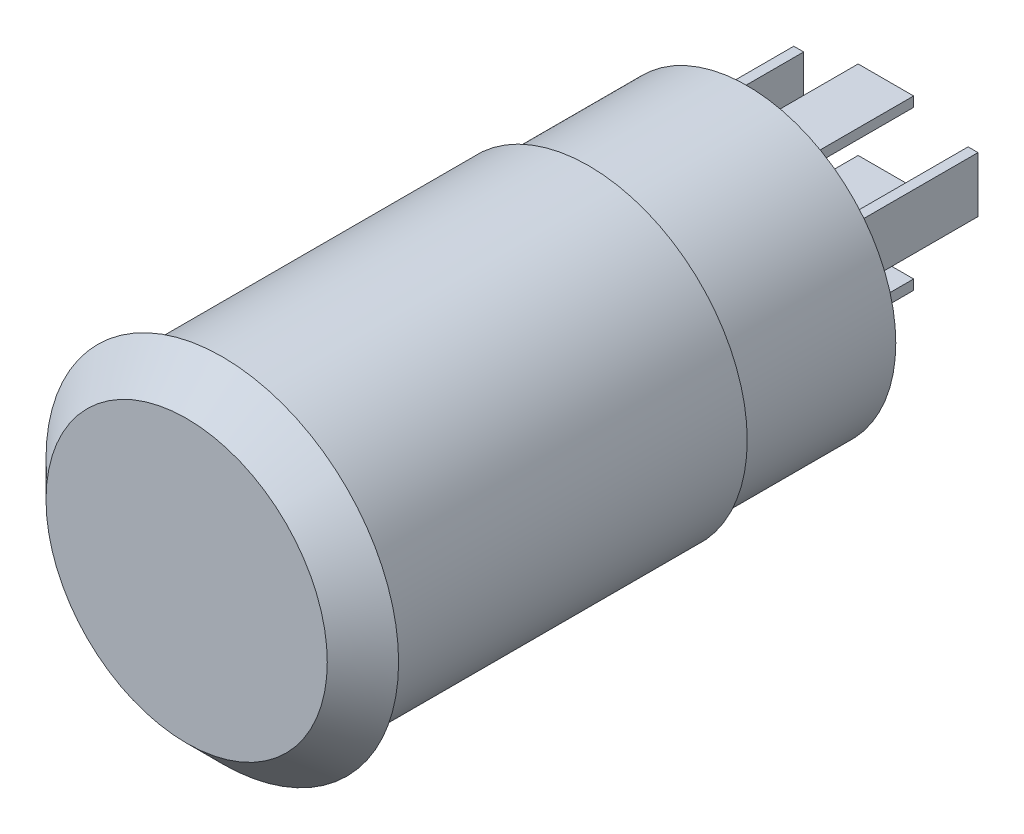
ISO-10303-21;
HEADER;
FILE_DESCRIPTION(('STEP AP214'),'2;1');
FILE_NAME('part.step','',(''),(''),'','','');
FILE_SCHEMA(('AUTOMOTIVE_DESIGN { 1 0 10303 214 1 1 1 1 }'));
ENDSEC;
DATA;
#1=APPLICATION_CONTEXT('core data for automotive mechanical design processes');
#2=APPLICATION_PROTOCOL_DEFINITION('international standard','automotive_design',2000,#1);
#3=PRODUCT_CONTEXT('',#1,'mechanical');
#4=PRODUCT('Part','Part','',(#3));
#5=PRODUCT_RELATED_PRODUCT_CATEGORY('part','',(#4));
#6=PRODUCT_DEFINITION_FORMATION('','',#4);
#7=PRODUCT_DEFINITION_CONTEXT('part definition',#1,'design');
#8=PRODUCT_DEFINITION('design','',#6,#7);
#9=PRODUCT_DEFINITION_SHAPE('','',#8);
#10=(LENGTH_UNIT() NAMED_UNIT(*) SI_UNIT(.MILLI.,.METRE.));
#11=(NAMED_UNIT(*) PLANE_ANGLE_UNIT() SI_UNIT($,.RADIAN.));
#12=(NAMED_UNIT(*) SI_UNIT($,.STERADIAN.) SOLID_ANGLE_UNIT());
#13=UNCERTAINTY_MEASURE_WITH_UNIT(LENGTH_MEASURE(1.E-05),#10,'distance_accuracy_value','');
#14=(GEOMETRIC_REPRESENTATION_CONTEXT(3) GLOBAL_UNCERTAINTY_ASSIGNED_CONTEXT((#13)) GLOBAL_UNIT_ASSIGNED_CONTEXT((#10,
#11,#12)) REPRESENTATION_CONTEXT('',''));
#15=CARTESIAN_POINT('',(0.,0.,0.));
#16=DIRECTION('',(0.,0.,1.));
#17=DIRECTION('',(1.,0.,0.));
#18=AXIS2_PLACEMENT_3D('',#15,#16,#17);
#19=CARTESIAN_POINT('',(0.,0.,-26.5));
#20=DIRECTION('',(0.,0.,1.));
#21=DIRECTION('',(1.,0.,0.));
#22=AXIS2_PLACEMENT_3D('',#19,#20,#21);
#23=CYLINDRICAL_SURFACE('',#22,8.);
#24=CARTESIAN_POINT('',(0.,0.,0.));
#25=DIRECTION('',(0.,0.,-1.));
#26=DIRECTION('',(-1.,0.,0.));
#27=AXIS2_PLACEMENT_3D('',#24,#25,#26);
#28=CIRCLE('',#27,8.);
#29=CARTESIAN_POINT('',(-8.,0.,0.));
#30=VERTEX_POINT('',#29);
#31=EDGE_CURVE('E12',#30,#30,#28,.T.);
#32=ORIENTED_EDGE('',*,*,#31,.T.);
#33=EDGE_LOOP('',(#32));
#34=FACE_BOUND('',#33,.T.);
#35=CARTESIAN_POINT('',(0.,0.,-18.5));
#36=DIRECTION('',(0.,0.,-1.));
#37=DIRECTION('',(-1.,0.,0.));
#38=AXIS2_PLACEMENT_3D('',#35,#36,#37);
#39=CIRCLE('',#38,8.);
#40=CARTESIAN_POINT('',(-8.,0.,-18.5));
#41=VERTEX_POINT('',#40);
#42=EDGE_CURVE('E207',#41,#41,#39,.T.);
#43=ORIENTED_EDGE('',*,*,#42,.F.);
#44=EDGE_LOOP('',(#43));
#45=FACE_BOUND('',#44,.T.);
#46=ADVANCED_FACE('F39',(#34,#45),#23,.T.);
#47=CARTESIAN_POINT('',(0.,0.,0.));
#48=DIRECTION('',(0.,0.,-1.));
#49=DIRECTION('',(1.,0.,0.));
#50=AXIS2_PLACEMENT_3D('',#47,#48,#49);
#51=CONICAL_SURFACE('',#50,8.9,0.78539816339745);
#52=CARTESIAN_POINT('',(0.,0.,1.8));
#53=DIRECTION('',(0.,0.,1.));
#54=DIRECTION('',(1.,0.,0.));
#55=AXIS2_PLACEMENT_3D('',#52,#53,#54);
#56=CIRCLE('',#55,7.09999999999999);
#57=CARTESIAN_POINT('',(7.09999999999999,0.,1.8));
#58=VERTEX_POINT('',#57);
#59=EDGE_CURVE('E43',#58,#58,#56,.T.);
#60=ORIENTED_EDGE('',*,*,#59,.F.);
#61=EDGE_LOOP('',(#60));
#62=FACE_BOUND('',#61,.T.);
#63=CARTESIAN_POINT('',(0.,0.,0.));
#64=DIRECTION('',(0.,0.,1.));
#65=DIRECTION('',(1.,0.,0.));
#66=AXIS2_PLACEMENT_3D('',#63,#64,#65);
#67=CIRCLE('',#66,8.9);
#68=CARTESIAN_POINT('',(8.9,0.,0.));
#69=VERTEX_POINT('',#68);
#70=EDGE_CURVE('E342',#69,#69,#67,.T.);
#71=ORIENTED_EDGE('',*,*,#70,.T.);
#72=EDGE_LOOP('',(#71));
#73=FACE_BOUND('',#72,.T.);
#74=ADVANCED_FACE('F41',(#62,#73),#51,.T.);
#75=CARTESIAN_POINT('',(0.,0.,1.8));
#76=DIRECTION('',(0.,0.,1.));
#77=DIRECTION('',(1.,0.,0.));
#78=AXIS2_PLACEMENT_3D('',#75,#76,#77);
#79=PLANE('',#78);
#80=ORIENTED_EDGE('',*,*,#59,.T.);
#81=EDGE_LOOP('',(#80));
#82=FACE_BOUND('',#81,.T.);
#83=ADVANCED_FACE('F349',(#82),#79,.T.);
#84=CARTESIAN_POINT('',(0.,0.,0.));
#85=DIRECTION('',(0.,0.,1.));
#86=DIRECTION('',(1.,0.,0.));
#87=AXIS2_PLACEMENT_3D('',#84,#85,#86);
#88=PLANE('',#87);
#89=ORIENTED_EDGE('',*,*,#31,.F.);
#90=EDGE_LOOP('',(#89));
#91=FACE_BOUND('',#90,.T.);
#92=ORIENTED_EDGE('',*,*,#70,.F.);
#93=EDGE_LOOP('',(#92));
#94=FACE_BOUND('',#93,.T.);
#95=ADVANCED_FACE('F356',(#91,#94),#88,.F.);
#96=CARTESIAN_POINT('',(0.,0.,-18.5));
#97=DIRECTION('',(0.,0.,-1.));
#98=DIRECTION('',(-1.,0.,0.));
#99=AXIS2_PLACEMENT_3D('',#96,#97,#98);
#100=PLANE('',#99);
#101=CARTESIAN_POINT('',(0.,0.,-18.5));
#102=DIRECTION('',(0.,0.,-1.));
#103=DIRECTION('',(-1.,0.,0.));
#104=AXIS2_PLACEMENT_3D('',#101,#102,#103);
#105=CIRCLE('',#104,7.5);
#106=CARTESIAN_POINT('',(-7.5,0.,-18.5));
#107=VERTEX_POINT('',#106);
#108=EDGE_CURVE('E494',#107,#107,#105,.T.);
#109=ORIENTED_EDGE('',*,*,#108,.F.);
#110=EDGE_LOOP('',(#109));
#111=FACE_BOUND('',#110,.T.);
#112=ORIENTED_EDGE('',*,*,#42,.T.);
#113=EDGE_LOOP('',(#112));
#114=FACE_BOUND('',#113,.T.);
#115=ADVANCED_FACE('F367',(#111,#114),#100,.T.);
#116=CARTESIAN_POINT('',(0.,0.,-18.5));
#117=DIRECTION('',(0.,0.,-1.));
#118=DIRECTION('',(-1.,0.,0.));
#119=AXIS2_PLACEMENT_3D('',#116,#117,#118);
#120=CYLINDRICAL_SURFACE('',#119,7.5);
#121=ORIENTED_EDGE('',*,*,#108,.T.);
#122=EDGE_LOOP('',(#121));
#123=FACE_BOUND('',#122,.T.);
#124=CARTESIAN_POINT('',(0.,0.,-26.5));
#125=DIRECTION('',(0.,0.,-1.));
#126=DIRECTION('',(-1.,0.,0.));
#127=AXIS2_PLACEMENT_3D('',#124,#125,#126);
#128=CIRCLE('',#127,7.5);
#129=CARTESIAN_POINT('',(-7.5,0.,-26.5));
#130=VERTEX_POINT('',#129);
#131=EDGE_CURVE('E492',#130,#130,#128,.T.);
#132=ORIENTED_EDGE('',*,*,#131,.F.);
#133=EDGE_LOOP('',(#132));
#134=FACE_BOUND('',#133,.T.);
#135=ADVANCED_FACE('F372',(#123,#134),#120,.T.);
#136=CARTESIAN_POINT('',(0.,0.,-33.5));
#137=DIRECTION('',(0.,0.,1.));
#138=DIRECTION('',(1.,0.,0.));
#139=AXIS2_PLACEMENT_3D('',#136,#137,#138);
#140=PLANE('',#139);
#141=DIRECTION('',(-1.,0.,0.));
#142=VECTOR('',#141,1.);
#143=CARTESIAN_POINT('',(1.4,-0.25,-33.5));
#144=LINE('',#143,#142);
#145=CARTESIAN_POINT('',(1.4,-0.25,-33.5));
#146=VERTEX_POINT('',#145);
#147=CARTESIAN_POINT('',(-1.4,-0.25,-33.5));
#148=VERTEX_POINT('',#147);
#149=EDGE_CURVE('E312',#146,#148,#144,.T.);
#150=ORIENTED_EDGE('',*,*,#149,.T.);
#151=DIRECTION('',(0.,-1.,0.));
#152=VECTOR('',#151,1.);
#153=CARTESIAN_POINT('',(-1.4,0.25,-33.5));
#154=LINE('',#153,#152);
#155=CARTESIAN_POINT('',(-1.4,0.25,-33.5));
#156=VERTEX_POINT('',#155);
#157=EDGE_CURVE('E314',#156,#148,#154,.T.);
#158=ORIENTED_EDGE('',*,*,#157,.F.);
#159=DIRECTION('',(-1.,0.,0.));
#160=VECTOR('',#159,1.);
#161=CARTESIAN_POINT('',(1.4,0.25,-33.5));
#162=LINE('',#161,#160);
#163=CARTESIAN_POINT('',(1.4,0.25,-33.5));
#164=VERTEX_POINT('',#163);
#165=EDGE_CURVE('E318',#164,#156,#162,.T.);
#166=ORIENTED_EDGE('',*,*,#165,.F.);
#167=DIRECTION('',(0.,1.,0.));
#168=VECTOR('',#167,1.);
#169=CARTESIAN_POINT('',(1.4,-0.25,-33.5));
#170=LINE('',#169,#168);
#171=EDGE_CURVE('E321',#146,#164,#170,.T.);
#172=ORIENTED_EDGE('',*,*,#171,.F.);
#173=EDGE_LOOP('',(#150,#158,#166,#172));
#174=FACE_BOUND('',#173,.T.);
#175=ADVANCED_FACE('F380',(#174),#140,.F.);
#176=CARTESIAN_POINT('',(0.,0.,-33.5));
#177=DIRECTION('',(0.,0.,-1.));
#178=DIRECTION('',(-1.,0.,0.));
#179=AXIS2_PLACEMENT_3D('',#176,#177,#178);
#180=PLANE('',#179);
#181=DIRECTION('',(0.,1.,0.));
#182=VECTOR('',#181,1.);
#183=CARTESIAN_POINT('',(4.65,3.4,-33.5));
#184=LINE('',#183,#182);
#185=CARTESIAN_POINT('',(4.65,3.4,-33.5));
#186=VERTEX_POINT('',#185);
#187=CARTESIAN_POINT('',(4.65,0.6,-33.5));
#188=VERTEX_POINT('',#187);
#189=EDGE_CURVE('E280',#186,#188,#184,.F.);
#190=ORIENTED_EDGE('',*,*,#189,.T.);
#191=DIRECTION('',(1.,0.,0.));
#192=VECTOR('',#191,1.);
#193=CARTESIAN_POINT('',(4.15,0.6,-33.5));
#194=LINE('',#193,#192);
#195=CARTESIAN_POINT('',(4.15,0.6,-33.5));
#196=VERTEX_POINT('',#195);
#197=EDGE_CURVE('E282',#196,#188,#194,.T.);
#198=ORIENTED_EDGE('',*,*,#197,.F.);
#199=DIRECTION('',(0.,1.,0.));
#200=VECTOR('',#199,1.);
#201=CARTESIAN_POINT('',(4.15,3.4,-33.5));
#202=LINE('',#201,#200);
#203=CARTESIAN_POINT('',(4.15,3.4,-33.5));
#204=VERTEX_POINT('',#203);
#205=EDGE_CURVE('E286',#204,#196,#202,.F.);
#206=ORIENTED_EDGE('',*,*,#205,.F.);
#207=DIRECTION('',(-1.,0.,0.));
#208=VECTOR('',#207,1.);
#209=CARTESIAN_POINT('',(4.65,3.4,-33.5));
#210=LINE('',#209,#208);
#211=EDGE_CURVE('E289',#186,#204,#210,.T.);
#212=ORIENTED_EDGE('',*,*,#211,.F.);
#213=EDGE_LOOP('',(#190,#198,#206,#212));
#214=FACE_BOUND('',#213,.T.);
#215=ADVANCED_FACE('F425',(#214),#180,.T.);
#216=CARTESIAN_POINT('',(0.,0.,-33.5));
#217=DIRECTION('',(0.,0.,1.));
#218=DIRECTION('',(1.,0.,0.));
#219=AXIS2_PLACEMENT_3D('',#216,#217,#218);
#220=PLANE('',#219);
#221=DIRECTION('',(-1.,0.,0.));
#222=VECTOR('',#221,1.);
#223=CARTESIAN_POINT('',(1.4,3.75,-33.5));
#224=LINE('',#223,#222);
#225=CARTESIAN_POINT('',(1.4,3.75,-33.5));
#226=VERTEX_POINT('',#225);
#227=CARTESIAN_POINT('',(-1.4,3.75,-33.5));
#228=VERTEX_POINT('',#227);
#229=EDGE_CURVE('E248',#226,#228,#224,.T.);
#230=ORIENTED_EDGE('',*,*,#229,.T.);
#231=DIRECTION('',(0.,-1.,0.));
#232=VECTOR('',#231,1.);
#233=CARTESIAN_POINT('',(-1.4,4.25,-33.5));
#234=LINE('',#233,#232);
#235=CARTESIAN_POINT('',(-1.4,4.25,-33.5));
#236=VERTEX_POINT('',#235);
#237=EDGE_CURVE('E250',#236,#228,#234,.T.);
#238=ORIENTED_EDGE('',*,*,#237,.F.);
#239=DIRECTION('',(-1.,0.,0.));
#240=VECTOR('',#239,1.);
#241=CARTESIAN_POINT('',(1.4,4.25,-33.5));
#242=LINE('',#241,#240);
#243=CARTESIAN_POINT('',(1.4,4.25,-33.5));
#244=VERTEX_POINT('',#243);
#245=EDGE_CURVE('E254',#244,#236,#242,.T.);
#246=ORIENTED_EDGE('',*,*,#245,.F.);
#247=DIRECTION('',(0.,1.,0.));
#248=VECTOR('',#247,1.);
#249=CARTESIAN_POINT('',(1.4,3.75,-33.5));
#250=LINE('',#249,#248);
#251=EDGE_CURVE('E257',#226,#244,#250,.T.);
#252=ORIENTED_EDGE('',*,*,#251,.F.);
#253=EDGE_LOOP('',(#230,#238,#246,#252));
#254=FACE_BOUND('',#253,.T.);
#255=ADVANCED_FACE('F405',(#254),#220,.F.);
#256=CARTESIAN_POINT('',(0.,0.,-33.5));
#257=DIRECTION('',(0.,0.,-1.));
#258=DIRECTION('',(-1.,0.,0.));
#259=AXIS2_PLACEMENT_3D('',#256,#257,#258);
#260=PLANE('',#259);
#261=DIRECTION('',(0.,1.,0.));
#262=VECTOR('',#261,1.);
#263=CARTESIAN_POINT('',(-4.15,3.4,-33.5));
#264=LINE('',#263,#262);
#265=CARTESIAN_POINT('',(-4.15,3.4,-33.5));
#266=VERTEX_POINT('',#265);
#267=CARTESIAN_POINT('',(-4.15,0.6,-33.5));
#268=VERTEX_POINT('',#267);
#269=EDGE_CURVE('E216',#266,#268,#264,.F.);
#270=ORIENTED_EDGE('',*,*,#269,.T.);
#271=DIRECTION('',(1.,0.,0.));
#272=VECTOR('',#271,1.);
#273=CARTESIAN_POINT('',(-4.65,0.6,-33.5));
#274=LINE('',#273,#272);
#275=CARTESIAN_POINT('',(-4.65,0.6,-33.5));
#276=VERTEX_POINT('',#275);
#277=EDGE_CURVE('E218',#276,#268,#274,.T.);
#278=ORIENTED_EDGE('',*,*,#277,.F.);
#279=DIRECTION('',(0.,1.,0.));
#280=VECTOR('',#279,1.);
#281=CARTESIAN_POINT('',(-4.65,3.4,-33.5));
#282=LINE('',#281,#280);
#283=CARTESIAN_POINT('',(-4.65,3.4,-33.5));
#284=VERTEX_POINT('',#283);
#285=EDGE_CURVE('E222',#284,#276,#282,.F.);
#286=ORIENTED_EDGE('',*,*,#285,.F.);
#287=DIRECTION('',(-1.,0.,0.));
#288=VECTOR('',#287,1.);
#289=CARTESIAN_POINT('',(-4.15,3.4,-33.5));
#290=LINE('',#289,#288);
#291=EDGE_CURVE('E225',#266,#284,#290,.T.);
#292=ORIENTED_EDGE('',*,*,#291,.F.);
#293=EDGE_LOOP('',(#270,#278,#286,#292));
#294=FACE_BOUND('',#293,.T.);
#295=ADVANCED_FACE('F389',(#294),#260,.T.);
#296=CARTESIAN_POINT('',(0.,0.,-33.5));
#297=DIRECTION('',(0.,0.,1.));
#298=DIRECTION('',(1.,0.,0.));
#299=AXIS2_PLACEMENT_3D('',#296,#297,#298);
#300=PLANE('',#299);
#301=DIRECTION('',(-1.,0.,0.));
#302=VECTOR('',#301,1.);
#303=CARTESIAN_POINT('',(1.4,-4.25,-33.5));
#304=LINE('',#303,#302);
#305=CARTESIAN_POINT('',(1.4,-4.25,-33.5));
#306=VERTEX_POINT('',#305);
#307=CARTESIAN_POINT('',(-1.40000000000001,-4.25,-33.5));
#308=VERTEX_POINT('',#307);
#309=EDGE_CURVE('E177',#306,#308,#304,.T.);
#310=ORIENTED_EDGE('',*,*,#309,.T.);
#311=DIRECTION('',(0.,-1.,0.));
#312=VECTOR('',#311,1.);
#313=CARTESIAN_POINT('',(-1.40000000000001,-3.75,-33.5));
#314=LINE('',#313,#312);
#315=CARTESIAN_POINT('',(-1.40000000000001,-3.75,-33.5));
#316=VERTEX_POINT('',#315);
#317=EDGE_CURVE('E182',#316,#308,#314,.T.);
#318=ORIENTED_EDGE('',*,*,#317,.F.);
#319=DIRECTION('',(-1.,0.,0.));
#320=VECTOR('',#319,1.);
#321=CARTESIAN_POINT('',(1.4,-3.75,-33.5));
#322=LINE('',#321,#320);
#323=CARTESIAN_POINT('',(1.4,-3.75,-33.5));
#324=VERTEX_POINT('',#323);
#325=EDGE_CURVE('E199',#324,#316,#322,.T.);
#326=ORIENTED_EDGE('',*,*,#325,.F.);
#327=DIRECTION('',(0.,1.,0.));
#328=VECTOR('',#327,1.);
#329=CARTESIAN_POINT('',(1.4,-4.25,-33.5));
#330=LINE('',#329,#328);
#331=EDGE_CURVE('E185',#306,#324,#330,.T.);
#332=ORIENTED_EDGE('',*,*,#331,.F.);
#333=EDGE_LOOP('',(#310,#318,#326,#332));
#334=FACE_BOUND('',#333,.T.);
#335=ADVANCED_FACE('F179',(#334),#300,.F.);
#336=CARTESIAN_POINT('',(1.4,0.25,-33.5));
#337=DIRECTION('',(0.,1.,0.));
#338=DIRECTION('',(0.,0.,1.));
#339=AXIS2_PLACEMENT_3D('',#336,#337,#338);
#340=PLANE('',#339);
#341=DIRECTION('',(-1.,0.,0.));
#342=VECTOR('',#341,1.);
#343=CARTESIAN_POINT('',(1.4,0.25,-26.5));
#344=LINE('',#343,#342);
#345=CARTESIAN_POINT('',(1.4,0.25,-26.5));
#346=VERTEX_POINT('',#345);
#347=CARTESIAN_POINT('',(-1.4,0.25,-26.5));
#348=VERTEX_POINT('',#347);
#349=EDGE_CURVE('E329',#346,#348,#344,.T.);
#350=ORIENTED_EDGE('',*,*,#349,.F.);
#351=DIRECTION('',(0.,0.,1.));
#352=VECTOR('',#351,1.);
#353=CARTESIAN_POINT('',(1.4,0.25,-33.5));
#354=LINE('',#353,#352);
#355=EDGE_CURVE('E334',#164,#346,#354,.T.);
#356=ORIENTED_EDGE('',*,*,#355,.F.);
#357=ORIENTED_EDGE('',*,*,#165,.T.);
#358=DIRECTION('',(0.,0.,1.));
#359=VECTOR('',#358,1.);
#360=CARTESIAN_POINT('',(-1.4,0.25,-33.5));
#361=LINE('',#360,#359);
#362=EDGE_CURVE('E337',#156,#348,#361,.T.);
#363=ORIENTED_EDGE('',*,*,#362,.T.);
#364=EDGE_LOOP('',(#350,#356,#357,#363));
#365=FACE_BOUND('',#364,.T.);
#366=ADVANCED_FACE('F388',(#365),#340,.T.);
#367=CARTESIAN_POINT('',(1.4,-0.25,-33.5));
#368=DIRECTION('',(1.,0.,0.));
#369=DIRECTION('',(0.,0.,-1.));
#370=AXIS2_PLACEMENT_3D('',#367,#368,#369);
#371=PLANE('',#370);
#372=DIRECTION('',(0.,1.,0.));
#373=VECTOR('',#372,1.);
#374=CARTESIAN_POINT('',(1.4,-0.25,-26.5));
#375=LINE('',#374,#373);
#376=CARTESIAN_POINT('',(1.4,-0.25,-26.5));
#377=VERTEX_POINT('',#376);
#378=EDGE_CURVE('E315',#377,#346,#375,.T.);
#379=ORIENTED_EDGE('',*,*,#378,.F.);
#380=DIRECTION('',(0.,0.,1.));
#381=VECTOR('',#380,1.);
#382=CARTESIAN_POINT('',(1.4,-0.25,-33.5));
#383=LINE('',#382,#381);
#384=EDGE_CURVE('E324',#146,#377,#383,.T.);
#385=ORIENTED_EDGE('',*,*,#384,.F.);
#386=ORIENTED_EDGE('',*,*,#171,.T.);
#387=ORIENTED_EDGE('',*,*,#355,.T.);
#388=EDGE_LOOP('',(#379,#385,#386,#387));
#389=FACE_BOUND('',#388,.T.);
#390=ADVANCED_FACE('F465',(#389),#371,.T.);
#391=CARTESIAN_POINT('',(1.4,-0.25,-33.5));
#392=DIRECTION('',(0.,1.,0.));
#393=DIRECTION('',(0.,0.,1.));
#394=AXIS2_PLACEMENT_3D('',#391,#392,#393);
#395=PLANE('',#394);
#396=DIRECTION('',(-1.,0.,0.));
#397=VECTOR('',#396,1.);
#398=CARTESIAN_POINT('',(1.4,-0.25,-26.5));
#399=LINE('',#398,#397);
#400=CARTESIAN_POINT('',(-1.4,-0.25,-26.5));
#401=VERTEX_POINT('',#400);
#402=EDGE_CURVE('E311',#377,#401,#399,.T.);
#403=ORIENTED_EDGE('',*,*,#402,.T.);
#404=DIRECTION('',(0.,0.,1.));
#405=VECTOR('',#404,1.);
#406=CARTESIAN_POINT('',(-1.4,-0.25,-33.5));
#407=LINE('',#406,#405);
#408=EDGE_CURVE('E340',#148,#401,#407,.T.);
#409=ORIENTED_EDGE('',*,*,#408,.F.);
#410=ORIENTED_EDGE('',*,*,#149,.F.);
#411=ORIENTED_EDGE('',*,*,#384,.T.);
#412=EDGE_LOOP('',(#403,#409,#410,#411));
#413=FACE_BOUND('',#412,.T.);
#414=ADVANCED_FACE('F468',(#413),#395,.F.);
#415=CARTESIAN_POINT('',(-1.4,0.25,-33.5));
#416=DIRECTION('',(-1.,0.,0.));
#417=DIRECTION('',(0.,0.,1.));
#418=AXIS2_PLACEMENT_3D('',#415,#416,#417);
#419=PLANE('',#418);
#420=DIRECTION('',(0.,-1.,0.));
#421=VECTOR('',#420,1.);
#422=CARTESIAN_POINT('',(-1.4,0.25,-26.5));
#423=LINE('',#422,#421);
#424=EDGE_CURVE('E327',#348,#401,#423,.T.);
#425=ORIENTED_EDGE('',*,*,#424,.F.);
#426=ORIENTED_EDGE('',*,*,#362,.F.);
#427=ORIENTED_EDGE('',*,*,#157,.T.);
#428=ORIENTED_EDGE('',*,*,#408,.T.);
#429=EDGE_LOOP('',(#425,#426,#427,#428));
#430=FACE_BOUND('',#429,.T.);
#431=ADVANCED_FACE('F454',(#430),#419,.T.);
#432=CARTESIAN_POINT('',(4.15,3.4,-33.5));
#433=DIRECTION('',(-1.,0.,0.));
#434=DIRECTION('',(0.,0.,1.));
#435=AXIS2_PLACEMENT_3D('',#432,#433,#434);
#436=PLANE('',#435);
#437=DIRECTION('',(0.,1.,0.));
#438=VECTOR('',#437,1.);
#439=CARTESIAN_POINT('',(4.15,3.4,-26.5));
#440=LINE('',#439,#438);
#441=CARTESIAN_POINT('',(4.15,3.4,-26.5));
#442=VERTEX_POINT('',#441);
#443=CARTESIAN_POINT('',(4.15,0.6,-26.5));
#444=VERTEX_POINT('',#443);
#445=EDGE_CURVE('E297',#442,#444,#440,.F.);
#446=ORIENTED_EDGE('',*,*,#445,.F.);
#447=DIRECTION('',(0.,0.,1.));
#448=VECTOR('',#447,1.);
#449=CARTESIAN_POINT('',(4.15,3.4,-33.5));
#450=LINE('',#449,#448);
#451=EDGE_CURVE('E302',#204,#442,#450,.T.);
#452=ORIENTED_EDGE('',*,*,#451,.F.);
#453=ORIENTED_EDGE('',*,*,#205,.T.);
#454=DIRECTION('',(0.,0.,1.));
#455=VECTOR('',#454,1.);
#456=CARTESIAN_POINT('',(4.15,0.6,-33.5));
#457=LINE('',#456,#455);
#458=EDGE_CURVE('E305',#196,#444,#457,.T.);
#459=ORIENTED_EDGE('',*,*,#458,.T.);
#460=EDGE_LOOP('',(#446,#452,#453,#459));
#461=FACE_BOUND('',#460,.T.);
#462=ADVANCED_FACE('F450',(#461),#436,.T.);
#463=CARTESIAN_POINT('',(4.65,3.4,-33.5));
#464=DIRECTION('',(0.,1.,0.));
#465=DIRECTION('',(0.,0.,1.));
#466=AXIS2_PLACEMENT_3D('',#463,#464,#465);
#467=PLANE('',#466);
#468=DIRECTION('',(-1.,0.,0.));
#469=VECTOR('',#468,1.);
#470=CARTESIAN_POINT('',(4.65,3.4,-26.5));
#471=LINE('',#470,#469);
#472=CARTESIAN_POINT('',(4.65,3.4,-26.5));
#473=VERTEX_POINT('',#472);
#474=EDGE_CURVE('E283',#473,#442,#471,.T.);
#475=ORIENTED_EDGE('',*,*,#474,.F.);
#476=DIRECTION('',(0.,0.,1.));
#477=VECTOR('',#476,1.);
#478=CARTESIAN_POINT('',(4.65,3.4,-33.5));
#479=LINE('',#478,#477);
#480=EDGE_CURVE('E292',#186,#473,#479,.T.);
#481=ORIENTED_EDGE('',*,*,#480,.F.);
#482=ORIENTED_EDGE('',*,*,#211,.T.);
#483=ORIENTED_EDGE('',*,*,#451,.T.);
#484=EDGE_LOOP('',(#475,#481,#482,#483));
#485=FACE_BOUND('',#484,.T.);
#486=ADVANCED_FACE('F446',(#485),#467,.T.);
#487=CARTESIAN_POINT('',(4.65,3.4,-33.5));
#488=DIRECTION('',(-1.,0.,0.));
#489=DIRECTION('',(0.,0.,1.));
#490=AXIS2_PLACEMENT_3D('',#487,#488,#489);
#491=PLANE('',#490);
#492=DIRECTION('',(0.,1.,0.));
#493=VECTOR('',#492,1.);
#494=CARTESIAN_POINT('',(4.65,3.4,-26.5));
#495=LINE('',#494,#493);
#496=CARTESIAN_POINT('',(4.65,0.6,-26.5));
#497=VERTEX_POINT('',#496);
#498=EDGE_CURVE('E279',#473,#497,#495,.F.);
#499=ORIENTED_EDGE('',*,*,#498,.T.);
#500=DIRECTION('',(0.,0.,1.));
#501=VECTOR('',#500,1.);
#502=CARTESIAN_POINT('',(4.65,0.6,-33.5));
#503=LINE('',#502,#501);
#504=EDGE_CURVE('E308',#188,#497,#503,.T.);
#505=ORIENTED_EDGE('',*,*,#504,.F.);
#506=ORIENTED_EDGE('',*,*,#189,.F.);
#507=ORIENTED_EDGE('',*,*,#480,.T.);
#508=EDGE_LOOP('',(#499,#505,#506,#507));
#509=FACE_BOUND('',#508,.T.);
#510=ADVANCED_FACE('F449',(#509),#491,.F.);
#511=CARTESIAN_POINT('',(4.15,0.6,-33.5));
#512=DIRECTION('',(0.,-1.,0.));
#513=DIRECTION('',(0.,0.,-1.));
#514=AXIS2_PLACEMENT_3D('',#511,#512,#513);
#515=PLANE('',#514);
#516=DIRECTION('',(1.,0.,0.));
#517=VECTOR('',#516,1.);
#518=CARTESIAN_POINT('',(4.15,0.6,-26.5));
#519=LINE('',#518,#517);
#520=EDGE_CURVE('E295',#444,#497,#519,.T.);
#521=ORIENTED_EDGE('',*,*,#520,.F.);
#522=ORIENTED_EDGE('',*,*,#458,.F.);
#523=ORIENTED_EDGE('',*,*,#197,.T.);
#524=ORIENTED_EDGE('',*,*,#504,.T.);
#525=EDGE_LOOP('',(#521,#522,#523,#524));
#526=FACE_BOUND('',#525,.T.);
#527=ADVANCED_FACE('F435',(#526),#515,.T.);
#528=CARTESIAN_POINT('',(1.4,4.25,-33.5));
#529=DIRECTION('',(0.,1.,0.));
#530=DIRECTION('',(0.,0.,1.));
#531=AXIS2_PLACEMENT_3D('',#528,#529,#530);
#532=PLANE('',#531);
#533=DIRECTION('',(-1.,0.,0.));
#534=VECTOR('',#533,1.);
#535=CARTESIAN_POINT('',(1.4,4.25,-26.5));
#536=LINE('',#535,#534);
#537=CARTESIAN_POINT('',(1.4,4.25,-26.5));
#538=VERTEX_POINT('',#537);
#539=CARTESIAN_POINT('',(-1.4,4.25,-26.5));
#540=VERTEX_POINT('',#539);
#541=EDGE_CURVE('E265',#538,#540,#536,.T.);
#542=ORIENTED_EDGE('',*,*,#541,.F.);
#543=DIRECTION('',(0.,0.,1.));
#544=VECTOR('',#543,1.);
#545=CARTESIAN_POINT('',(1.4,4.25,-33.5));
#546=LINE('',#545,#544);
#547=EDGE_CURVE('E270',#244,#538,#546,.T.);
#548=ORIENTED_EDGE('',*,*,#547,.F.);
#549=ORIENTED_EDGE('',*,*,#245,.T.);
#550=DIRECTION('',(0.,0.,1.));
#551=VECTOR('',#550,1.);
#552=CARTESIAN_POINT('',(-1.4,4.25,-33.5));
#553=LINE('',#552,#551);
#554=EDGE_CURVE('E273',#236,#540,#553,.T.);
#555=ORIENTED_EDGE('',*,*,#554,.T.);
#556=EDGE_LOOP('',(#542,#548,#549,#555));
#557=FACE_BOUND('',#556,.T.);
#558=ADVANCED_FACE('F431',(#557),#532,.T.);
#559=CARTESIAN_POINT('',(1.4,3.75,-33.5));
#560=DIRECTION('',(1.,0.,0.));
#561=DIRECTION('',(0.,0.,-1.));
#562=AXIS2_PLACEMENT_3D('',#559,#560,#561);
#563=PLANE('',#562);
#564=DIRECTION('',(0.,1.,0.));
#565=VECTOR('',#564,1.);
#566=CARTESIAN_POINT('',(1.4,3.75,-26.5));
#567=LINE('',#566,#565);
#568=CARTESIAN_POINT('',(1.4,3.75,-26.5));
#569=VERTEX_POINT('',#568);
#570=EDGE_CURVE('E251',#569,#538,#567,.T.);
#571=ORIENTED_EDGE('',*,*,#570,.F.);
#572=DIRECTION('',(0.,0.,1.));
#573=VECTOR('',#572,1.);
#574=CARTESIAN_POINT('',(1.4,3.75,-33.5));
#575=LINE('',#574,#573);
#576=EDGE_CURVE('E260',#226,#569,#575,.T.);
#577=ORIENTED_EDGE('',*,*,#576,.F.);
#578=ORIENTED_EDGE('',*,*,#251,.T.);
#579=ORIENTED_EDGE('',*,*,#547,.T.);
#580=EDGE_LOOP('',(#571,#577,#578,#579));
#581=FACE_BOUND('',#580,.T.);
#582=ADVANCED_FACE('F427',(#581),#563,.T.);
#583=CARTESIAN_POINT('',(1.4,3.75,-33.5));
#584=DIRECTION('',(0.,1.,0.));
#585=DIRECTION('',(0.,0.,1.));
#586=AXIS2_PLACEMENT_3D('',#583,#584,#585);
#587=PLANE('',#586);
#588=DIRECTION('',(-1.,0.,0.));
#589=VECTOR('',#588,1.);
#590=CARTESIAN_POINT('',(1.4,3.75,-26.5));
#591=LINE('',#590,#589);
#592=CARTESIAN_POINT('',(-1.4,3.75,-26.5));
#593=VERTEX_POINT('',#592);
#594=EDGE_CURVE('E247',#569,#593,#591,.T.);
#595=ORIENTED_EDGE('',*,*,#594,.T.);
#596=DIRECTION('',(0.,0.,1.));
#597=VECTOR('',#596,1.);
#598=CARTESIAN_POINT('',(-1.4,3.75,-33.5));
#599=LINE('',#598,#597);
#600=EDGE_CURVE('E276',#228,#593,#599,.T.);
#601=ORIENTED_EDGE('',*,*,#600,.F.);
#602=ORIENTED_EDGE('',*,*,#229,.F.);
#603=ORIENTED_EDGE('',*,*,#576,.T.);
#604=EDGE_LOOP('',(#595,#601,#602,#603));
#605=FACE_BOUND('',#604,.T.);
#606=ADVANCED_FACE('F430',(#605),#587,.F.);
#607=CARTESIAN_POINT('',(-1.4,4.25,-33.5));
#608=DIRECTION('',(-1.,0.,0.));
#609=DIRECTION('',(0.,0.,1.));
#610=AXIS2_PLACEMENT_3D('',#607,#608,#609);
#611=PLANE('',#610);
#612=DIRECTION('',(0.,-1.,0.));
#613=VECTOR('',#612,1.);
#614=CARTESIAN_POINT('',(-1.4,4.25,-26.5));
#615=LINE('',#614,#613);
#616=EDGE_CURVE('E263',#540,#593,#615,.T.);
#617=ORIENTED_EDGE('',*,*,#616,.F.);
#618=ORIENTED_EDGE('',*,*,#554,.F.);
#619=ORIENTED_EDGE('',*,*,#237,.T.);
#620=ORIENTED_EDGE('',*,*,#600,.T.);
#621=EDGE_LOOP('',(#617,#618,#619,#620));
#622=FACE_BOUND('',#621,.T.);
#623=ADVANCED_FACE('F415',(#622),#611,.T.);
#624=CARTESIAN_POINT('',(-4.65,3.4,-33.5));
#625=DIRECTION('',(-1.,0.,0.));
#626=DIRECTION('',(0.,0.,1.));
#627=AXIS2_PLACEMENT_3D('',#624,#625,#626);
#628=PLANE('',#627);
#629=DIRECTION('',(0.,1.,0.));
#630=VECTOR('',#629,1.);
#631=CARTESIAN_POINT('',(-4.65,3.4,-26.5));
#632=LINE('',#631,#630);
#633=CARTESIAN_POINT('',(-4.65,3.4,-26.5));
#634=VERTEX_POINT('',#633);
#635=CARTESIAN_POINT('',(-4.65,0.6,-26.5));
#636=VERTEX_POINT('',#635);
#637=EDGE_CURVE('E233',#634,#636,#632,.F.);
#638=ORIENTED_EDGE('',*,*,#637,.F.);
#639=DIRECTION('',(0.,0.,1.));
#640=VECTOR('',#639,1.);
#641=CARTESIAN_POINT('',(-4.65,3.4,-33.5));
#642=LINE('',#641,#640);
#643=EDGE_CURVE('E238',#284,#634,#642,.T.);
#644=ORIENTED_EDGE('',*,*,#643,.F.);
#645=ORIENTED_EDGE('',*,*,#285,.T.);
#646=DIRECTION('',(0.,0.,1.));
#647=VECTOR('',#646,1.);
#648=CARTESIAN_POINT('',(-4.65,0.6,-33.5));
#649=LINE('',#648,#647);
#650=EDGE_CURVE('E241',#276,#636,#649,.T.);
#651=ORIENTED_EDGE('',*,*,#650,.T.);
#652=EDGE_LOOP('',(#638,#644,#645,#651));
#653=FACE_BOUND('',#652,.T.);
#654=ADVANCED_FACE('F411',(#653),#628,.T.);
#655=CARTESIAN_POINT('',(-4.15,3.4,-33.5));
#656=DIRECTION('',(0.,1.,0.));
#657=DIRECTION('',(0.,0.,1.));
#658=AXIS2_PLACEMENT_3D('',#655,#656,#657);
#659=PLANE('',#658);
#660=DIRECTION('',(-1.,0.,0.));
#661=VECTOR('',#660,1.);
#662=CARTESIAN_POINT('',(-4.15,3.4,-26.5));
#663=LINE('',#662,#661);
#664=CARTESIAN_POINT('',(-4.15,3.4,-26.5));
#665=VERTEX_POINT('',#664);
#666=EDGE_CURVE('E219',#665,#634,#663,.T.);
#667=ORIENTED_EDGE('',*,*,#666,.F.);
#668=DIRECTION('',(0.,0.,1.));
#669=VECTOR('',#668,1.);
#670=CARTESIAN_POINT('',(-4.15,3.4,-33.5));
#671=LINE('',#670,#669);
#672=EDGE_CURVE('E228',#266,#665,#671,.T.);
#673=ORIENTED_EDGE('',*,*,#672,.F.);
#674=ORIENTED_EDGE('',*,*,#291,.T.);
#675=ORIENTED_EDGE('',*,*,#643,.T.);
#676=EDGE_LOOP('',(#667,#673,#674,#675));
#677=FACE_BOUND('',#676,.T.);
#678=ADVANCED_FACE('F407',(#677),#659,.T.);
#679=CARTESIAN_POINT('',(-4.15,3.4,-33.5));
#680=DIRECTION('',(-1.,0.,0.));
#681=DIRECTION('',(0.,0.,1.));
#682=AXIS2_PLACEMENT_3D('',#679,#680,#681);
#683=PLANE('',#682);
#684=DIRECTION('',(0.,1.,0.));
#685=VECTOR('',#684,1.);
#686=CARTESIAN_POINT('',(-4.15,3.4,-26.5));
#687=LINE('',#686,#685);
#688=CARTESIAN_POINT('',(-4.15,0.6,-26.5));
#689=VERTEX_POINT('',#688);
#690=EDGE_CURVE('E195',#665,#689,#687,.F.);
#691=ORIENTED_EDGE('',*,*,#690,.T.);
#692=DIRECTION('',(0.,0.,1.));
#693=VECTOR('',#692,1.);
#694=CARTESIAN_POINT('',(-4.15,0.6,-33.5));
#695=LINE('',#694,#693);
#696=EDGE_CURVE('E244',#268,#689,#695,.T.);
#697=ORIENTED_EDGE('',*,*,#696,.F.);
#698=ORIENTED_EDGE('',*,*,#269,.F.);
#699=ORIENTED_EDGE('',*,*,#672,.T.);
#700=EDGE_LOOP('',(#691,#697,#698,#699));
#701=FACE_BOUND('',#700,.T.);
#702=ADVANCED_FACE('F410',(#701),#683,.F.);
#703=CARTESIAN_POINT('',(-4.65,0.6,-33.5));
#704=DIRECTION('',(0.,-1.,0.));
#705=DIRECTION('',(0.,0.,-1.));
#706=AXIS2_PLACEMENT_3D('',#703,#704,#705);
#707=PLANE('',#706);
#708=DIRECTION('',(1.,0.,0.));
#709=VECTOR('',#708,1.);
#710=CARTESIAN_POINT('',(-4.65,0.6,-26.5));
#711=LINE('',#710,#709);
#712=EDGE_CURVE('E231',#636,#689,#711,.T.);
#713=ORIENTED_EDGE('',*,*,#712,.F.);
#714=ORIENTED_EDGE('',*,*,#650,.F.);
#715=ORIENTED_EDGE('',*,*,#277,.T.);
#716=ORIENTED_EDGE('',*,*,#696,.T.);
#717=EDGE_LOOP('',(#713,#714,#715,#716));
#718=FACE_BOUND('',#717,.T.);
#719=ADVANCED_FACE('F397',(#718),#707,.T.);
#720=CARTESIAN_POINT('',(1.4,-3.75,-33.5));
#721=DIRECTION('',(0.,1.,0.));
#722=DIRECTION('',(0.,0.,1.));
#723=AXIS2_PLACEMENT_3D('',#720,#721,#722);
#724=PLANE('',#723);
#725=DIRECTION('',(-1.,0.,0.));
#726=VECTOR('',#725,1.);
#727=CARTESIAN_POINT('',(1.4,-3.75,-26.5));
#728=LINE('',#727,#726);
#729=CARTESIAN_POINT('',(1.4,-3.75,-26.5));
#730=VERTEX_POINT('',#729);
#731=CARTESIAN_POINT('',(-1.40000000000001,-3.75,-26.5));
#732=VERTEX_POINT('',#731);
#733=EDGE_CURVE('E60',#730,#732,#728,.T.);
#734=ORIENTED_EDGE('',*,*,#733,.F.);
#735=DIRECTION('',(0.,0.,1.));
#736=VECTOR('',#735,1.);
#737=CARTESIAN_POINT('',(1.4,-3.75,-33.5));
#738=LINE('',#737,#736);
#739=EDGE_CURVE('E212',#324,#730,#738,.T.);
#740=ORIENTED_EDGE('',*,*,#739,.F.);
#741=ORIENTED_EDGE('',*,*,#325,.T.);
#742=DIRECTION('',(0.,0.,1.));
#743=VECTOR('',#742,1.);
#744=CARTESIAN_POINT('',(-1.40000000000001,-3.75,-33.5));
#745=LINE('',#744,#743);
#746=EDGE_CURVE('E196',#316,#732,#745,.T.);
#747=ORIENTED_EDGE('',*,*,#746,.T.);
#748=EDGE_LOOP('',(#734,#740,#741,#747));
#749=FACE_BOUND('',#748,.T.);
#750=ADVANCED_FACE('F393',(#749),#724,.T.);
#751=CARTESIAN_POINT('',(1.4,-4.25,-33.5));
#752=DIRECTION('',(1.,0.,0.));
#753=DIRECTION('',(0.,0.,-1.));
#754=AXIS2_PLACEMENT_3D('',#751,#752,#753);
#755=PLANE('',#754);
#756=DIRECTION('',(0.,1.,0.));
#757=VECTOR('',#756,1.);
#758=CARTESIAN_POINT('',(1.4,-4.25,-26.5));
#759=LINE('',#758,#757);
#760=CARTESIAN_POINT('',(1.4,-4.25,-26.5));
#761=VERTEX_POINT('',#760);
#762=EDGE_CURVE('E188',#761,#730,#759,.T.);
#763=ORIENTED_EDGE('',*,*,#762,.F.);
#764=DIRECTION('',(0.,0.,1.));
#765=VECTOR('',#764,1.);
#766=CARTESIAN_POINT('',(1.4,-4.25,-33.5));
#767=LINE('',#766,#765);
#768=EDGE_CURVE('E205',#306,#761,#767,.T.);
#769=ORIENTED_EDGE('',*,*,#768,.F.);
#770=ORIENTED_EDGE('',*,*,#331,.T.);
#771=ORIENTED_EDGE('',*,*,#739,.T.);
#772=EDGE_LOOP('',(#763,#769,#770,#771));
#773=FACE_BOUND('',#772,.T.);
#774=ADVANCED_FACE('F390',(#773),#755,.T.);
#775=CARTESIAN_POINT('',(1.4,-4.25,-33.5));
#776=DIRECTION('',(0.,1.,0.));
#777=DIRECTION('',(0.,0.,1.));
#778=AXIS2_PLACEMENT_3D('',#775,#776,#777);
#779=PLANE('',#778);
#780=DIRECTION('',(-1.,0.,0.));
#781=VECTOR('',#780,1.);
#782=CARTESIAN_POINT('',(1.4,-4.25,-26.5));
#783=LINE('',#782,#781);
#784=CARTESIAN_POINT('',(-1.40000000000001,-4.25,-26.5));
#785=VERTEX_POINT('',#784);
#786=EDGE_CURVE('E193',#761,#785,#783,.T.);
#787=ORIENTED_EDGE('',*,*,#786,.T.);
#788=DIRECTION('',(0.,0.,1.));
#789=VECTOR('',#788,1.);
#790=CARTESIAN_POINT('',(-1.40000000000001,-4.25,-33.5));
#791=LINE('',#790,#789);
#792=EDGE_CURVE('E191',#308,#785,#791,.T.);
#793=ORIENTED_EDGE('',*,*,#792,.F.);
#794=ORIENTED_EDGE('',*,*,#309,.F.);
#795=ORIENTED_EDGE('',*,*,#768,.T.);
#796=EDGE_LOOP('',(#787,#793,#794,#795));
#797=FACE_BOUND('',#796,.T.);
#798=ADVANCED_FACE('F192',(#797),#779,.F.);
#799=CARTESIAN_POINT('',(-1.40000000000001,-3.75,-33.5));
#800=DIRECTION('',(-1.,0.,0.));
#801=DIRECTION('',(0.,0.,1.));
#802=AXIS2_PLACEMENT_3D('',#799,#800,#801);
#803=PLANE('',#802);
#804=DIRECTION('',(0.,-1.,0.));
#805=VECTOR('',#804,1.);
#806=CARTESIAN_POINT('',(-1.40000000000001,-3.75,-26.5));
#807=LINE('',#806,#805);
#808=EDGE_CURVE('E55',#732,#785,#807,.T.);
#809=ORIENTED_EDGE('',*,*,#808,.F.);
#810=ORIENTED_EDGE('',*,*,#746,.F.);
#811=ORIENTED_EDGE('',*,*,#317,.T.);
#812=ORIENTED_EDGE('',*,*,#792,.T.);
#813=EDGE_LOOP('',(#809,#810,#811,#812));
#814=FACE_BOUND('',#813,.T.);
#815=ADVANCED_FACE('F198',(#814),#803,.T.);
#816=CARTESIAN_POINT('',(0.,0.,-26.5));
#817=DIRECTION('',(0.,0.,-1.));
#818=DIRECTION('',(-1.,0.,0.));
#819=AXIS2_PLACEMENT_3D('',#816,#817,#818);
#820=PLANE('',#819);
#821=ORIENTED_EDGE('',*,*,#808,.T.);
#822=ORIENTED_EDGE('',*,*,#786,.F.);
#823=ORIENTED_EDGE('',*,*,#762,.T.);
#824=ORIENTED_EDGE('',*,*,#733,.T.);
#825=EDGE_LOOP('',(#821,#822,#823,#824));
#826=FACE_BOUND('',#825,.T.);
#827=ORIENTED_EDGE('',*,*,#712,.T.);
#828=ORIENTED_EDGE('',*,*,#690,.F.);
#829=ORIENTED_EDGE('',*,*,#666,.T.);
#830=ORIENTED_EDGE('',*,*,#637,.T.);
#831=EDGE_LOOP('',(#827,#828,#829,#830));
#832=FACE_BOUND('',#831,.T.);
#833=ORIENTED_EDGE('',*,*,#616,.T.);
#834=ORIENTED_EDGE('',*,*,#594,.F.);
#835=ORIENTED_EDGE('',*,*,#570,.T.);
#836=ORIENTED_EDGE('',*,*,#541,.T.);
#837=EDGE_LOOP('',(#833,#834,#835,#836));
#838=FACE_BOUND('',#837,.T.);
#839=ORIENTED_EDGE('',*,*,#520,.T.);
#840=ORIENTED_EDGE('',*,*,#498,.F.);
#841=ORIENTED_EDGE('',*,*,#474,.T.);
#842=ORIENTED_EDGE('',*,*,#445,.T.);
#843=EDGE_LOOP('',(#839,#840,#841,#842));
#844=FACE_BOUND('',#843,.T.);
#845=ORIENTED_EDGE('',*,*,#424,.T.);
#846=ORIENTED_EDGE('',*,*,#402,.F.);
#847=ORIENTED_EDGE('',*,*,#378,.T.);
#848=ORIENTED_EDGE('',*,*,#349,.T.);
#849=EDGE_LOOP('',(#845,#846,#847,#848));
#850=FACE_BOUND('',#849,.T.);
#851=ORIENTED_EDGE('',*,*,#131,.T.);
#852=EDGE_LOOP('',(#851));
#853=FACE_BOUND('',#852,.T.);
#854=ADVANCED_FACE('F364',(#826,#832,#838,#844,#850,#853),#820,.T.);
#855=CLOSED_SHELL('',(#46,#74,#83,#95,#115,#135,#175,#215,#255,#295,#335,#366,#390,#414,#431,
#462,#486,#510,#527,#558,#582,#606,#623,#654,#678,#702,#719,#750,#774,#798,#815,#854));
#856=MANIFOLD_SOLID_BREP('B2',#855);
#857=ADVANCED_BREP_SHAPE_REPRESENTATION('',(#18,#856),#14);
#858=SHAPE_DEFINITION_REPRESENTATION(#9,#857);
ENDSEC;
END-ISO-10303-21;
